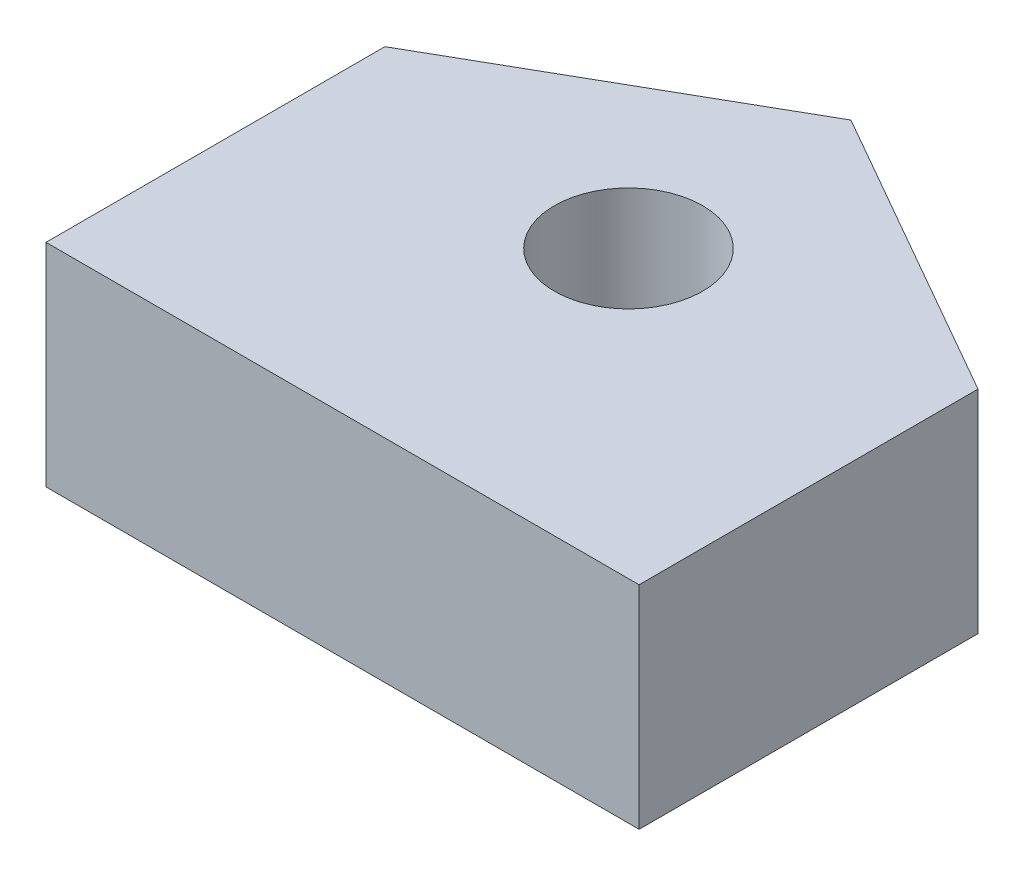
ISO-10303-21;
HEADER;
FILE_DESCRIPTION(('STEP AP214'),'2;1');
FILE_NAME('part.step','',(''),(''),'','','');
FILE_SCHEMA(('AUTOMOTIVE_DESIGN { 1 0 10303 214 1 1 1 1 }'));
ENDSEC;
DATA;
#1=APPLICATION_CONTEXT('core data for automotive mechanical design processes');
#2=APPLICATION_PROTOCOL_DEFINITION('international standard','automotive_design',2000,#1);
#3=PRODUCT_CONTEXT('',#1,'mechanical');
#4=PRODUCT('Part','Part','',(#3));
#5=PRODUCT_RELATED_PRODUCT_CATEGORY('part','',(#4));
#6=PRODUCT_DEFINITION_FORMATION('','',#4);
#7=PRODUCT_DEFINITION_CONTEXT('part definition',#1,'design');
#8=PRODUCT_DEFINITION('design','',#6,#7);
#9=PRODUCT_DEFINITION_SHAPE('','',#8);
#10=(LENGTH_UNIT() NAMED_UNIT(*) SI_UNIT(.MILLI.,.METRE.));
#11=(NAMED_UNIT(*) PLANE_ANGLE_UNIT() SI_UNIT($,.RADIAN.));
#12=(NAMED_UNIT(*) SI_UNIT($,.STERADIAN.) SOLID_ANGLE_UNIT());
#13=UNCERTAINTY_MEASURE_WITH_UNIT(LENGTH_MEASURE(1.E-05),#10,'distance_accuracy_value','');
#14=(GEOMETRIC_REPRESENTATION_CONTEXT(3) GLOBAL_UNCERTAINTY_ASSIGNED_CONTEXT((#13)) GLOBAL_UNIT_ASSIGNED_CONTEXT((#10,
#11,#12)) REPRESENTATION_CONTEXT('',''));
#15=CARTESIAN_POINT('',(0.,0.,0.));
#16=DIRECTION('',(0.,0.,1.));
#17=DIRECTION('',(1.,0.,0.));
#18=AXIS2_PLACEMENT_3D('',#15,#16,#17);
#19=CARTESIAN_POINT('',(0.,5.,0.));
#20=DIRECTION('',(0.,1.,0.));
#21=DIRECTION('',(0.,0.,1.));
#22=AXIS2_PLACEMENT_3D('',#19,#20,#21);
#23=PLANE('',#22);
#24=DIRECTION('',(1.,0.,0.));
#25=VECTOR('',#24,1.);
#26=CARTESIAN_POINT('',(-268.,5.,56.75));
#27=LINE('',#26,#25);
#28=CARTESIAN_POINT('',(-268.,5.,56.75));
#29=VERTEX_POINT('',#28);
#30=CARTESIAN_POINT('',(-254.,5.,56.75));
#31=VERTEX_POINT('',#30);
#32=EDGE_CURVE('E141',#29,#31,#27,.T.);
#33=ORIENTED_EDGE('',*,*,#32,.T.);
#34=DIRECTION('',(0.,0.,-1.));
#35=VECTOR('',#34,1.);
#36=CARTESIAN_POINT('',(-254.,5.,56.75));
#37=LINE('',#36,#35);
#38=CARTESIAN_POINT('',(-254.,5.,48.75));
#39=VERTEX_POINT('',#38);
#40=EDGE_CURVE('E99',#31,#39,#37,.T.);
#41=ORIENTED_EDGE('',*,*,#40,.T.);
#42=DIRECTION('',(-0.868243142124459,0.,-0.496138938356834));
#43=VECTOR('',#42,1.);
#44=CARTESIAN_POINT('',(-254.,5.,48.75));
#45=LINE('',#44,#43);
#46=CARTESIAN_POINT('',(-261.,5.,44.75));
#47=VERTEX_POINT('',#46);
#48=EDGE_CURVE('E103',#39,#47,#45,.T.);
#49=ORIENTED_EDGE('',*,*,#48,.T.);
#50=DIRECTION('',(-0.868243142124459,0.,0.496138938356834));
#51=VECTOR('',#50,1.);
#52=CARTESIAN_POINT('',(-261.,5.,44.75));
#53=LINE('',#52,#51);
#54=CARTESIAN_POINT('',(-268.,5.,48.75));
#55=VERTEX_POINT('',#54);
#56=EDGE_CURVE('E107',#47,#55,#53,.T.);
#57=ORIENTED_EDGE('',*,*,#56,.T.);
#58=DIRECTION('',(0.,0.,1.));
#59=VECTOR('',#58,1.);
#60=CARTESIAN_POINT('',(-268.,5.,48.75));
#61=LINE('',#60,#59);
#62=EDGE_CURVE('E65',#55,#29,#61,.T.);
#63=ORIENTED_EDGE('',*,*,#62,.T.);
#64=EDGE_LOOP('',(#33,#41,#49,#57,#63));
#65=FACE_BOUND('',#64,.T.);
#66=CARTESIAN_POINT('',(-261.,5.,50.));
#67=DIRECTION('',(0.,1.,0.));
#68=DIRECTION('',(0.,0.,-1.));
#69=AXIS2_PLACEMENT_3D('',#66,#67,#68);
#70=CIRCLE('',#69,1.75000000000004);
#71=CARTESIAN_POINT('',(-261.,5.,48.25));
#72=VERTEX_POINT('',#71);
#73=EDGE_CURVE('E132',#72,#72,#70,.T.);
#74=ORIENTED_EDGE('',*,*,#73,.F.);
#75=EDGE_LOOP('',(#74));
#76=FACE_BOUND('',#75,.T.);
#77=ADVANCED_FACE('F47',(#65,#76),#23,.T.);
#78=CARTESIAN_POINT('',(0.,0.,0.));
#79=DIRECTION('',(0.,1.,0.));
#80=DIRECTION('',(0.,0.,1.));
#81=AXIS2_PLACEMENT_3D('',#78,#79,#80);
#82=PLANE('',#81);
#83=DIRECTION('',(1.,0.,0.));
#84=VECTOR('',#83,1.);
#85=CARTESIAN_POINT('',(-268.,0.,56.75));
#86=LINE('',#85,#84);
#87=CARTESIAN_POINT('',(-268.,0.,56.75));
#88=VERTEX_POINT('',#87);
#89=CARTESIAN_POINT('',(-254.,0.,56.75));
#90=VERTEX_POINT('',#89);
#91=EDGE_CURVE('E127',#88,#90,#86,.T.);
#92=ORIENTED_EDGE('',*,*,#91,.F.);
#93=DIRECTION('',(0.,0.,1.));
#94=VECTOR('',#93,1.);
#95=CARTESIAN_POINT('',(-268.,0.,48.75));
#96=LINE('',#95,#94);
#97=CARTESIAN_POINT('',(-268.,0.,48.75));
#98=VERTEX_POINT('',#97);
#99=EDGE_CURVE('E91',#98,#88,#96,.T.);
#100=ORIENTED_EDGE('',*,*,#99,.F.);
#101=DIRECTION('',(-0.868243142124459,0.,0.496138938356834));
#102=VECTOR('',#101,1.);
#103=CARTESIAN_POINT('',(-261.,0.,44.75));
#104=LINE('',#103,#102);
#105=CARTESIAN_POINT('',(-261.,0.,44.75));
#106=VERTEX_POINT('',#105);
#107=EDGE_CURVE('E85',#106,#98,#104,.T.);
#108=ORIENTED_EDGE('',*,*,#107,.F.);
#109=DIRECTION('',(-0.868243142124459,0.,-0.496138938356834));
#110=VECTOR('',#109,1.);
#111=CARTESIAN_POINT('',(-254.,0.,48.75));
#112=LINE('',#111,#110);
#113=CARTESIAN_POINT('',(-254.,0.,48.75));
#114=VERTEX_POINT('',#113);
#115=EDGE_CURVE('E115',#114,#106,#112,.T.);
#116=ORIENTED_EDGE('',*,*,#115,.F.);
#117=DIRECTION('',(0.,0.,-1.));
#118=VECTOR('',#117,1.);
#119=CARTESIAN_POINT('',(-254.,0.,56.75));
#120=LINE('',#119,#118);
#121=EDGE_CURVE('E131',#90,#114,#120,.T.);
#122=ORIENTED_EDGE('',*,*,#121,.F.);
#123=EDGE_LOOP('',(#92,#100,#108,#116,#122));
#124=FACE_BOUND('',#123,.T.);
#125=CARTESIAN_POINT('',(-261.,0.,50.));
#126=DIRECTION('',(0.,1.,0.));
#127=DIRECTION('',(0.,0.,-1.));
#128=AXIS2_PLACEMENT_3D('',#125,#126,#127);
#129=CIRCLE('',#128,1.75000000000004);
#130=CARTESIAN_POINT('',(-261.,0.,48.25));
#131=VERTEX_POINT('',#130);
#132=EDGE_CURVE('E224',#131,#131,#129,.T.);
#133=ORIENTED_EDGE('',*,*,#132,.T.);
#134=EDGE_LOOP('',(#133));
#135=FACE_BOUND('',#134,.T.);
#136=ADVANCED_FACE('F148',(#124,#135),#82,.F.);
#137=CARTESIAN_POINT('',(-268.,5.,56.75));
#138=DIRECTION('',(0.,0.,-1.));
#139=DIRECTION('',(-1.,0.,0.));
#140=AXIS2_PLACEMENT_3D('',#137,#138,#139);
#141=PLANE('',#140);
#142=ORIENTED_EDGE('',*,*,#91,.T.);
#143=DIRECTION('',(0.,-1.,0.));
#144=VECTOR('',#143,1.);
#145=CARTESIAN_POINT('',(-254.,5.,56.75));
#146=LINE('',#145,#144);
#147=EDGE_CURVE('E11',#31,#90,#146,.T.);
#148=ORIENTED_EDGE('',*,*,#147,.F.);
#149=ORIENTED_EDGE('',*,*,#32,.F.);
#150=DIRECTION('',(0.,-1.,0.));
#151=VECTOR('',#150,1.);
#152=CARTESIAN_POINT('',(-268.,5.,56.75));
#153=LINE('',#152,#151);
#154=EDGE_CURVE('E123',#29,#88,#153,.T.);
#155=ORIENTED_EDGE('',*,*,#154,.T.);
#156=EDGE_LOOP('',(#142,#148,#149,#155));
#157=FACE_BOUND('',#156,.T.);
#158=ADVANCED_FACE('F49',(#157),#141,.F.);
#159=CARTESIAN_POINT('',(-254.,5.,56.75));
#160=DIRECTION('',(-1.,0.,0.));
#161=DIRECTION('',(0.,0.,1.));
#162=AXIS2_PLACEMENT_3D('',#159,#160,#161);
#163=PLANE('',#162);
#164=ORIENTED_EDGE('',*,*,#121,.T.);
#165=DIRECTION('',(0.,-1.,0.));
#166=VECTOR('',#165,1.);
#167=CARTESIAN_POINT('',(-254.,5.,48.75));
#168=LINE('',#167,#166);
#169=EDGE_CURVE('E57',#39,#114,#168,.T.);
#170=ORIENTED_EDGE('',*,*,#169,.F.);
#171=ORIENTED_EDGE('',*,*,#40,.F.);
#172=ORIENTED_EDGE('',*,*,#147,.T.);
#173=EDGE_LOOP('',(#164,#170,#171,#172));
#174=FACE_BOUND('',#173,.T.);
#175=ADVANCED_FACE('F173',(#174),#163,.F.);
#176=CARTESIAN_POINT('',(-254.,5.,48.75));
#177=DIRECTION('',(-0.496138938356834,0.,0.868243142124459));
#178=DIRECTION('',(0.868243142124459,0.,0.496138938356834));
#179=AXIS2_PLACEMENT_3D('',#176,#177,#178);
#180=PLANE('',#179);
#181=ORIENTED_EDGE('',*,*,#115,.T.);
#182=DIRECTION('',(0.,-1.,0.));
#183=VECTOR('',#182,1.);
#184=CARTESIAN_POINT('',(-261.,5.,44.75));
#185=LINE('',#184,#183);
#186=EDGE_CURVE('E112',#47,#106,#185,.T.);
#187=ORIENTED_EDGE('',*,*,#186,.F.);
#188=ORIENTED_EDGE('',*,*,#48,.F.);
#189=ORIENTED_EDGE('',*,*,#169,.T.);
#190=EDGE_LOOP('',(#181,#187,#188,#189));
#191=FACE_BOUND('',#190,.T.);
#192=ADVANCED_FACE('F113',(#191),#180,.F.);
#193=CARTESIAN_POINT('',(-261.,5.,44.75));
#194=DIRECTION('',(0.496138938356834,0.,0.868243142124459));
#195=DIRECTION('',(0.868243142124459,0.,-0.496138938356834));
#196=AXIS2_PLACEMENT_3D('',#193,#194,#195);
#197=PLANE('',#196);
#198=ORIENTED_EDGE('',*,*,#107,.T.);
#199=DIRECTION('',(0.,-1.,0.));
#200=VECTOR('',#199,1.);
#201=CARTESIAN_POINT('',(-268.,5.,48.75));
#202=LINE('',#201,#200);
#203=EDGE_CURVE('E117',#55,#98,#202,.T.);
#204=ORIENTED_EDGE('',*,*,#203,.F.);
#205=ORIENTED_EDGE('',*,*,#56,.F.);
#206=ORIENTED_EDGE('',*,*,#186,.T.);
#207=EDGE_LOOP('',(#198,#204,#205,#206));
#208=FACE_BOUND('',#207,.T.);
#209=ADVANCED_FACE('F119',(#208),#197,.F.);
#210=CARTESIAN_POINT('',(-268.,5.,48.75));
#211=DIRECTION('',(1.,0.,0.));
#212=DIRECTION('',(0.,0.,-1.));
#213=AXIS2_PLACEMENT_3D('',#210,#211,#212);
#214=PLANE('',#213);
#215=ORIENTED_EDGE('',*,*,#99,.T.);
#216=ORIENTED_EDGE('',*,*,#154,.F.);
#217=ORIENTED_EDGE('',*,*,#62,.F.);
#218=ORIENTED_EDGE('',*,*,#203,.T.);
#219=EDGE_LOOP('',(#215,#216,#217,#218));
#220=FACE_BOUND('',#219,.T.);
#221=ADVANCED_FACE('F153',(#220),#214,.F.);
#222=CARTESIAN_POINT('',(-261.,5.,50.));
#223=DIRECTION('',(0.,-1.,0.));
#224=DIRECTION('',(0.,0.,-1.));
#225=AXIS2_PLACEMENT_3D('',#222,#223,#224);
#226=CYLINDRICAL_SURFACE('',#225,1.75000000000004);
#227=ORIENTED_EDGE('',*,*,#73,.T.);
#228=EDGE_LOOP('',(#227));
#229=FACE_BOUND('',#228,.T.);
#230=ORIENTED_EDGE('',*,*,#132,.F.);
#231=EDGE_LOOP('',(#230));
#232=FACE_BOUND('',#231,.T.);
#233=ADVANCED_FACE('F155',(#229,#232),#226,.F.);
#234=CLOSED_SHELL('',(#77,#136,#158,#175,#192,#209,#221,#233));
#235=MANIFOLD_SOLID_BREP('B2',#234);
#236=ADVANCED_BREP_SHAPE_REPRESENTATION('',(#18,#235),#14);
#237=SHAPE_DEFINITION_REPRESENTATION(#9,#236);
ENDSEC;
END-ISO-10303-21;
